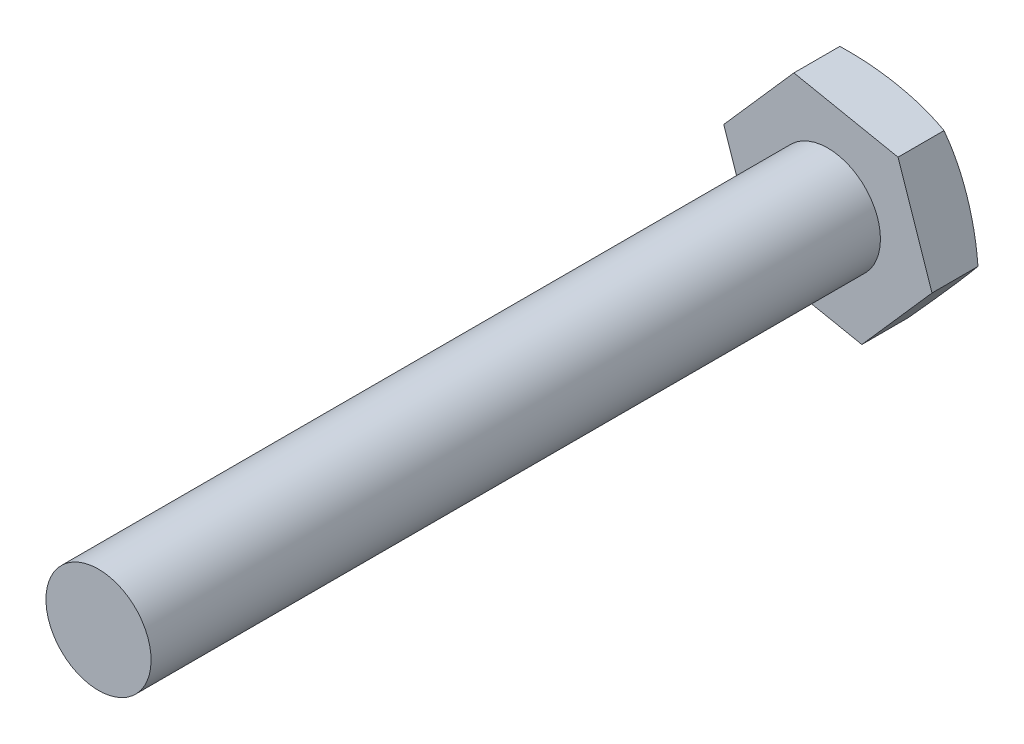
ISO-10303-21;
HEADER;
FILE_DESCRIPTION(('STEP AP214'),'2;1');
FILE_NAME('part.step','',(''),(''),'','','');
FILE_SCHEMA(('AUTOMOTIVE_DESIGN { 1 0 10303 214 1 1 1 1 }'));
ENDSEC;
DATA;
#1=APPLICATION_CONTEXT('core data for automotive mechanical design processes');
#2=APPLICATION_PROTOCOL_DEFINITION('international standard','automotive_design',2000,#1);
#3=PRODUCT_CONTEXT('',#1,'mechanical');
#4=PRODUCT('Part','Part','',(#3));
#5=PRODUCT_RELATED_PRODUCT_CATEGORY('part','',(#4));
#6=PRODUCT_DEFINITION_FORMATION('','',#4);
#7=PRODUCT_DEFINITION_CONTEXT('part definition',#1,'design');
#8=PRODUCT_DEFINITION('design','',#6,#7);
#9=PRODUCT_DEFINITION_SHAPE('','',#8);
#10=(LENGTH_UNIT() NAMED_UNIT(*) SI_UNIT(.MILLI.,.METRE.));
#11=(NAMED_UNIT(*) PLANE_ANGLE_UNIT() SI_UNIT($,.RADIAN.));
#12=(NAMED_UNIT(*) SI_UNIT($,.STERADIAN.) SOLID_ANGLE_UNIT());
#13=UNCERTAINTY_MEASURE_WITH_UNIT(LENGTH_MEASURE(1.E-05),#10,'distance_accuracy_value','');
#14=(GEOMETRIC_REPRESENTATION_CONTEXT(3) GLOBAL_UNCERTAINTY_ASSIGNED_CONTEXT((#13)) GLOBAL_UNIT_ASSIGNED_CONTEXT((#10,
#11,#12)) REPRESENTATION_CONTEXT('',''));
#15=CARTESIAN_POINT('',(0.,0.,0.));
#16=DIRECTION('',(0.,0.,1.));
#17=DIRECTION('',(1.,0.,0.));
#18=AXIS2_PLACEMENT_3D('',#15,#16,#17);
#19=CARTESIAN_POINT('',(0.,0.,-12.0620950460362));
#20=DIRECTION('',(0.,0.,1.));
#21=DIRECTION('',(-0.660629158616776,-0.750712404843087,0.));
#22=AXIS2_PLACEMENT_3D('',#19,#20,#21);
#23=DEGENERATE_TOROIDAL_SURFACE('',#22,1.60360211733348,15.825120832035,.T.);
#24=CARTESIAN_POINT('',(0.,0.,-27.5));
#25=DIRECTION('',(0.,0.,1.));
#26=DIRECTION('',(-0.660629158616776,-0.750712404843087,0.));
#27=AXIS2_PLACEMENT_3D('',#24,#25,#26);
#28=CIRCLE('',#27,5.08290376865477);
#29=CARTESIAN_POINT('',(3.35791444001644,3.81579891175281,-27.5));
#30=VERTEX_POINT('',#29);
#31=EDGE_CURVE('E11',#30,#30,#28,.T.);
#32=ORIENTED_EDGE('',*,*,#31,.T.);
#33=EDGE_LOOP('',(#32));
#34=FACE_BOUND('',#33,.T.);
#35=CARTESIAN_POINT('',(-5.33980191586677,-6.06793612628208,-26.5));
#36=CARTESIAN_POINT('',(-3.42857666963628,-6.45149758553837,-26.9374014168161));
#37=CARTESIAN_POINT('',(-1.38862462773706,-6.86089306812051,-26.9386953781707));
#38=CARTESIAN_POINT('',(0.662521676712027,-7.27253511357502,-26.9399964401544));
#39=CARTESIAN_POINT('',(2.58508587596822,-7.65837217345847,-26.5));
#40=B_SPLINE_CURVE_WITH_KNOTS('',2,(#35,#36,#37,#38,#39),.UNSPECIFIED.,.F.,.F.,(3,2,3),(0.,0.5,
1.),.UNSPECIFIED.);
#41=CARTESIAN_POINT('',(-5.33980191586677,-6.06793612628208,-26.5));
#42=VERTEX_POINT('',#41);
#43=CARTESIAN_POINT('',(2.58508587596823,-7.65837217345848,-26.5));
#44=VERTEX_POINT('',#43);
#45=EDGE_CURVE('E270',#42,#44,#40,.T.);
#46=ORIENTED_EDGE('',*,*,#45,.F.);
#47=CARTESIAN_POINT('',(-7.924887791835,1.59043604717639,-26.5));
#48=CARTESIAN_POINT('',(-7.30144913631892,-0.256514298128632,-26.9374014168368));
#49=CARTESIAN_POINT('',(-6.63602000350944,-2.22786233011927,-26.9386953781707));
#50=CARTESIAN_POINT('',(-5.96693931988491,-4.21002815946506,-26.9399964401338));
#51=CARTESIAN_POINT('',(-5.33980191586677,-6.06793612628208,-26.5));
#52=B_SPLINE_CURVE_WITH_KNOTS('',2,(#47,#48,#49,#50,#51),.UNSPECIFIED.,.F.,.F.,(3,2,3),(0.,0.5,
1.),.UNSPECIFIED.);
#53=CARTESIAN_POINT('',(-7.924887791835,1.59043604717639,-26.5));
#54=VERTEX_POINT('',#53);
#55=EDGE_CURVE('E198',#54,#42,#52,.T.);
#56=ORIENTED_EDGE('',*,*,#55,.F.);
#57=CARTESIAN_POINT('',(-2.58508587596823,7.65837217345848,-26.5));
#58=CARTESIAN_POINT('',(-3.88282871774633,6.1836694042695,-26.9407830938268));
#59=CARTESIAN_POINT('',(-5.26809479738887,4.60950874782281,-26.9386885989549));
#60=CARTESIAN_POINT('',(-6.63941599543196,3.05119449395197,-26.9366151884678));
#61=CARTESIAN_POINT('',(-7.924887791835,1.5904360471764,-26.5));
#62=B_SPLINE_CURVE_WITH_KNOTS('',2,(#57,#58,#59,#60,#61),.UNSPECIFIED.,.F.,.F.,(3,2,3),(0.,0.5,
1.),.UNSPECIFIED.);
#63=CARTESIAN_POINT('',(-2.58508587596822,7.65837217345848,-26.5));
#64=VERTEX_POINT('',#63);
#65=EDGE_CURVE('E128',#64,#54,#62,.T.);
#66=ORIENTED_EDGE('',*,*,#65,.F.);
#67=CARTESIAN_POINT('',(5.33980191586678,6.06793612628207,-26.5));
#68=CARTESIAN_POINT('',(3.4285766695762,6.45149758555041,-26.9374014168299));
#69=CARTESIAN_POINT('',(1.38862462773706,6.8608930681205,-26.9386953781707));
#70=CARTESIAN_POINT('',(-0.662521676772118,7.27253511358707,-26.9399964401407));
#71=CARTESIAN_POINT('',(-2.58508587596822,7.65837217345847,-26.5));
#72=B_SPLINE_CURVE_WITH_KNOTS('',2,(#67,#68,#69,#70,#71),.UNSPECIFIED.,.F.,.F.,(3,2,3),(0.,0.5,
1.),.UNSPECIFIED.);
#73=CARTESIAN_POINT('',(5.33980191586678,6.06793612628207,-26.5));
#74=VERTEX_POINT('',#73);
#75=EDGE_CURVE('E122',#74,#64,#72,.T.);
#76=ORIENTED_EDGE('',*,*,#75,.F.);
#77=CARTESIAN_POINT('',(7.924887791835,-1.59043604717641,-26.5));
#78=CARTESIAN_POINT('',(7.30144913632873,0.256514298099568,-26.9374014168299));
#79=CARTESIAN_POINT('',(6.63602000350944,2.22786233011925,-26.9386953781707));
#80=CARTESIAN_POINT('',(5.9669393198947,4.21002815943605,-26.9399964401407));
#81=CARTESIAN_POINT('',(5.33980191586677,6.06793612628207,-26.5));
#82=B_SPLINE_CURVE_WITH_KNOTS('',2,(#77,#78,#79,#80,#81),.UNSPECIFIED.,.F.,.F.,(3,2,3),(0.,0.5,
1.),.UNSPECIFIED.);
#83=CARTESIAN_POINT('',(7.924887791835,-1.59043604717642,-26.5));
#84=VERTEX_POINT('',#83);
#85=EDGE_CURVE('E125',#84,#74,#82,.T.);
#86=ORIENTED_EDGE('',*,*,#85,.F.);
#87=CARTESIAN_POINT('',(2.58508587596823,-7.65837217345848,-26.5));
#88=CARTESIAN_POINT('',(3.88282871774635,-6.18366940426948,-26.9407830938268));
#89=CARTESIAN_POINT('',(5.26809479739,-4.60950874782154,-26.9386885989549));
#90=CARTESIAN_POINT('',(6.63941599543196,-3.05119449395196,-26.9366151884678));
#91=CARTESIAN_POINT('',(7.924887791835,-1.59043604717641,-26.5));
#92=B_SPLINE_CURVE_WITH_KNOTS('',2,(#87,#88,#89,#90,#91),.UNSPECIFIED.,.F.,.F.,(3,2,3),(0.,0.5,
1.),.UNSPECIFIED.);
#93=EDGE_CURVE('E78',#44,#84,#92,.T.);
#94=ORIENTED_EDGE('',*,*,#93,.F.);
#95=EDGE_LOOP('',(#46,#56,#66,#76,#86,#94));
#96=FACE_BOUND('',#95,.T.);
#97=ADVANCED_FACE('F16',(#34,#96),#23,.T.);
#98=CARTESIAN_POINT('',(0.,0.,32.5));
#99=DIRECTION('',(0.,0.,-1.));
#100=DIRECTION('',(0.660629158616776,0.750712404843087,0.));
#101=AXIS2_PLACEMENT_3D('',#98,#99,#100);
#102=CYLINDRICAL_SURFACE('',#101,4.);
#103=CARTESIAN_POINT('',(0.,0.,32.5));
#104=DIRECTION('',(0.,0.,1.));
#105=DIRECTION('',(-0.660629158616776,-0.750712404843087,0.));
#106=AXIS2_PLACEMENT_3D('',#103,#104,#105);
#107=CIRCLE('',#106,4.);
#108=CARTESIAN_POINT('',(2.6425166344671,3.00284961937235,32.5));
#109=VERTEX_POINT('',#108);
#110=EDGE_CURVE('E67',#109,#109,#107,.T.);
#111=ORIENTED_EDGE('',*,*,#110,.F.);
#112=EDGE_LOOP('',(#111));
#113=FACE_BOUND('',#112,.T.);
#114=CARTESIAN_POINT('',(0.,0.,-23.));
#115=DIRECTION('',(0.,0.,1.));
#116=DIRECTION('',(-0.660629158616776,-0.750712404843087,0.));
#117=AXIS2_PLACEMENT_3D('',#114,#115,#116);
#118=CIRCLE('',#117,4.);
#119=CARTESIAN_POINT('',(2.6425166344671,3.00284961937235,-23.));
#120=VERTEX_POINT('',#119);
#121=EDGE_CURVE('E30',#120,#120,#118,.T.);
#122=ORIENTED_EDGE('',*,*,#121,.T.);
#123=EDGE_LOOP('',(#122));
#124=FACE_BOUND('',#123,.T.);
#125=ADVANCED_FACE('F183',(#113,#124),#102,.T.);
#126=CARTESIAN_POINT('',(0.,0.,32.5));
#127=DIRECTION('',(0.,0.,1.));
#128=DIRECTION('',(-0.660629158616776,-0.750712404843087,0.));
#129=AXIS2_PLACEMENT_3D('',#126,#127,#128);
#130=PLANE('',#129);
#131=ORIENTED_EDGE('',*,*,#110,.T.);
#132=EDGE_LOOP('',(#131));
#133=FACE_BOUND('',#132,.T.);
#134=ADVANCED_FACE('F344',(#133),#130,.T.);
#135=CARTESIAN_POINT('',(0.,0.,-23.));
#136=DIRECTION('',(0.,0.,1.));
#137=DIRECTION('',(-0.660629158616776,-0.750712404843087,0.));
#138=AXIS2_PLACEMENT_3D('',#135,#136,#137);
#139=PLANE('',#138);
#140=DIRECTION('',(0.319821434221834,-0.947477836264411,0.));
#141=VECTOR('',#140,1.);
#142=CARTESIAN_POINT('',(-7.924887791835,1.59043604717639,-23.));
#143=LINE('',#142,#141);
#144=CARTESIAN_POINT('',(-7.924887791835,1.59043604717639,-23.));
#145=VERTEX_POINT('',#144);
#146=CARTESIAN_POINT('',(-5.33980191586677,-6.06793612628208,-23.));
#147=VERTEX_POINT('',#146);
#148=EDGE_CURVE('E304',#145,#147,#143,.T.);
#149=ORIENTED_EDGE('',*,*,#148,.T.);
#150=DIRECTION('',(0.980450592838609,-0.196765431421323,0.));
#151=VECTOR('',#150,1.);
#152=CARTESIAN_POINT('',(-5.33980191586677,-6.06793612628208,-23.));
#153=LINE('',#152,#151);
#154=CARTESIAN_POINT('',(2.58508587596823,-7.65837217345848,-23.));
#155=VERTEX_POINT('',#154);
#156=EDGE_CURVE('E99',#147,#155,#153,.T.);
#157=ORIENTED_EDGE('',*,*,#156,.T.);
#158=DIRECTION('',(0.660629158616776,0.750712404843087,0.));
#159=VECTOR('',#158,1.);
#160=CARTESIAN_POINT('',(2.58508587596823,-7.65837217345848,-23.));
#161=LINE('',#160,#159);
#162=CARTESIAN_POINT('',(7.924887791835,-1.5904360471764,-23.));
#163=VERTEX_POINT('',#162);
#164=EDGE_CURVE('E110',#155,#163,#161,.T.);
#165=ORIENTED_EDGE('',*,*,#164,.T.);
#166=DIRECTION('',(-0.319821434221834,0.947477836264411,0.));
#167=VECTOR('',#166,1.);
#168=CARTESIAN_POINT('',(7.924887791835,-1.5904360471764,-23.));
#169=LINE('',#168,#167);
#170=CARTESIAN_POINT('',(5.33980191586677,6.06793612628207,-23.));
#171=VERTEX_POINT('',#170);
#172=EDGE_CURVE('E326',#163,#171,#169,.T.);
#173=ORIENTED_EDGE('',*,*,#172,.T.);
#174=DIRECTION('',(-0.980450592838609,0.196765431421323,0.));
#175=VECTOR('',#174,1.);
#176=CARTESIAN_POINT('',(5.33980191586677,6.06793612628207,-23.));
#177=LINE('',#176,#175);
#178=CARTESIAN_POINT('',(-2.58508587596824,7.65837217345847,-23.));
#179=VERTEX_POINT('',#178);
#180=EDGE_CURVE('E149',#171,#179,#177,.T.);
#181=ORIENTED_EDGE('',*,*,#180,.T.);
#182=DIRECTION('',(-0.660629158616776,-0.750712404843087,0.));
#183=VECTOR('',#182,1.);
#184=CARTESIAN_POINT('',(-2.58508587596824,7.65837217345847,-23.));
#185=LINE('',#184,#183);
#186=EDGE_CURVE('E290',#179,#145,#185,.T.);
#187=ORIENTED_EDGE('',*,*,#186,.T.);
#188=EDGE_LOOP('',(#149,#157,#165,#173,#181,#187));
#189=FACE_BOUND('',#188,.T.);
#190=ORIENTED_EDGE('',*,*,#121,.F.);
#191=EDGE_LOOP('',(#190));
#192=FACE_BOUND('',#191,.T.);
#193=ADVANCED_FACE('F181',(#189,#192),#139,.T.);
#194=CARTESIAN_POINT('',(-7.924887791835,1.59043604717639,-23.));
#195=DIRECTION('',(0.947477836264411,0.319821434221834,0.));
#196=DIRECTION('',(0.,0.,1.));
#197=AXIS2_PLACEMENT_3D('',#194,#195,#196);
#198=PLANE('',#197);
#199=DIRECTION('',(0.,0.,-1.));
#200=VECTOR('',#199,1.);
#201=CARTESIAN_POINT('',(-7.924887791835,1.59043604717639,-23.));
#202=LINE('',#201,#200);
#203=EDGE_CURVE('E203',#145,#54,#202,.T.);
#204=ORIENTED_EDGE('',*,*,#203,.T.);
#205=ORIENTED_EDGE('',*,*,#55,.T.);
#206=DIRECTION('',(0.,0.,-1.));
#207=VECTOR('',#206,1.);
#208=CARTESIAN_POINT('',(-5.33980191586677,-6.06793612628208,-23.));
#209=LINE('',#208,#207);
#210=EDGE_CURVE('E276',#147,#42,#209,.T.);
#211=ORIENTED_EDGE('',*,*,#210,.F.);
#212=ORIENTED_EDGE('',*,*,#148,.F.);
#213=EDGE_LOOP('',(#204,#205,#211,#212));
#214=FACE_BOUND('',#213,.T.);
#215=ADVANCED_FACE('F176',(#214),#198,.F.);
#216=CARTESIAN_POINT('',(-5.33980191586677,-6.06793612628208,-23.));
#217=DIRECTION('',(0.196765431421323,0.980450592838609,0.));
#218=DIRECTION('',(0.980450592838609,-0.196765431421323,0.));
#219=AXIS2_PLACEMENT_3D('',#216,#217,#218);
#220=PLANE('',#219);
#221=ORIENTED_EDGE('',*,*,#210,.T.);
#222=ORIENTED_EDGE('',*,*,#45,.T.);
#223=DIRECTION('',(0.,0.,-1.));
#224=VECTOR('',#223,1.);
#225=CARTESIAN_POINT('',(2.58508587596823,-7.65837217345848,-23.));
#226=LINE('',#225,#224);
#227=EDGE_CURVE('E268',#155,#44,#226,.T.);
#228=ORIENTED_EDGE('',*,*,#227,.F.);
#229=ORIENTED_EDGE('',*,*,#156,.F.);
#230=EDGE_LOOP('',(#221,#222,#228,#229));
#231=FACE_BOUND('',#230,.T.);
#232=ADVANCED_FACE('F180',(#231),#220,.F.);
#233=CARTESIAN_POINT('',(2.58508587596823,-7.65837217345848,-23.));
#234=DIRECTION('',(-0.750712404843087,0.660629158616776,0.));
#235=DIRECTION('',(0.,0.,-1.));
#236=AXIS2_PLACEMENT_3D('',#233,#234,#235);
#237=PLANE('',#236);
#238=ORIENTED_EDGE('',*,*,#227,.T.);
#239=ORIENTED_EDGE('',*,*,#93,.T.);
#240=DIRECTION('',(0.,0.,-1.));
#241=VECTOR('',#240,1.);
#242=CARTESIAN_POINT('',(7.924887791835,-1.5904360471764,-23.));
#243=LINE('',#242,#241);
#244=EDGE_CURVE('E143',#163,#84,#243,.T.);
#245=ORIENTED_EDGE('',*,*,#244,.F.);
#246=ORIENTED_EDGE('',*,*,#164,.F.);
#247=EDGE_LOOP('',(#238,#239,#245,#246));
#248=FACE_BOUND('',#247,.T.);
#249=ADVANCED_FACE('F254',(#248),#237,.F.);
#250=CARTESIAN_POINT('',(7.924887791835,-1.5904360471764,-23.));
#251=DIRECTION('',(-0.947477836264411,-0.319821434221834,0.));
#252=DIRECTION('',(0.,0.,-1.));
#253=AXIS2_PLACEMENT_3D('',#250,#251,#252);
#254=PLANE('',#253);
#255=ORIENTED_EDGE('',*,*,#244,.T.);
#256=ORIENTED_EDGE('',*,*,#85,.T.);
#257=DIRECTION('',(0.,0.,-1.));
#258=VECTOR('',#257,1.);
#259=CARTESIAN_POINT('',(5.33980191586677,6.06793612628207,-23.));
#260=LINE('',#259,#258);
#261=EDGE_CURVE('E135',#171,#74,#260,.T.);
#262=ORIENTED_EDGE('',*,*,#261,.F.);
#263=ORIENTED_EDGE('',*,*,#172,.F.);
#264=EDGE_LOOP('',(#255,#256,#262,#263));
#265=FACE_BOUND('',#264,.T.);
#266=ADVANCED_FACE('F18',(#265),#254,.F.);
#267=CARTESIAN_POINT('',(5.33980191586677,6.06793612628207,-23.));
#268=DIRECTION('',(-0.196765431421323,-0.980450592838609,0.));
#269=DIRECTION('',(0.,0.,-1.));
#270=AXIS2_PLACEMENT_3D('',#267,#268,#269);
#271=PLANE('',#270);
#272=ORIENTED_EDGE('',*,*,#261,.T.);
#273=ORIENTED_EDGE('',*,*,#75,.T.);
#274=DIRECTION('',(0.,0.,-1.));
#275=VECTOR('',#274,1.);
#276=CARTESIAN_POINT('',(-2.58508587596824,7.65837217345847,-23.));
#277=LINE('',#276,#275);
#278=EDGE_CURVE('E136',#179,#64,#277,.T.);
#279=ORIENTED_EDGE('',*,*,#278,.F.);
#280=ORIENTED_EDGE('',*,*,#180,.F.);
#281=EDGE_LOOP('',(#272,#273,#279,#280));
#282=FACE_BOUND('',#281,.T.);
#283=ADVANCED_FACE('F147',(#282),#271,.F.);
#284=CARTESIAN_POINT('',(-2.58508587596824,7.65837217345847,-23.));
#285=DIRECTION('',(0.750712404843087,-0.660629158616776,0.));
#286=DIRECTION('',(-0.660629158616776,-0.750712404843087,0.));
#287=AXIS2_PLACEMENT_3D('',#284,#285,#286);
#288=PLANE('',#287);
#289=ORIENTED_EDGE('',*,*,#278,.T.);
#290=ORIENTED_EDGE('',*,*,#65,.T.);
#291=ORIENTED_EDGE('',*,*,#203,.F.);
#292=ORIENTED_EDGE('',*,*,#186,.F.);
#293=EDGE_LOOP('',(#289,#290,#291,#292));
#294=FACE_BOUND('',#293,.T.);
#295=ADVANCED_FACE('F173',(#294),#288,.F.);
#296=CARTESIAN_POINT('',(0.,0.,-27.5));
#297=DIRECTION('',(0.,0.,1.));
#298=DIRECTION('',(-0.660629158616776,-0.750712404843087,0.));
#299=AXIS2_PLACEMENT_3D('',#296,#297,#298);
#300=PLANE('',#299);
#301=ORIENTED_EDGE('',*,*,#31,.F.);
#302=EDGE_LOOP('',(#301));
#303=FACE_BOUND('',#302,.T.);
#304=ADVANCED_FACE('F174',(#303),#300,.F.);
#305=CLOSED_SHELL('',(#97,#125,#134,#193,#215,#232,#249,#266,#283,#295,#304));
#306=MANIFOLD_SOLID_BREP('B1',#305);
#307=ADVANCED_BREP_SHAPE_REPRESENTATION('',(#18,#306),#14);
#308=SHAPE_DEFINITION_REPRESENTATION(#9,#307);
ENDSEC;
END-ISO-10303-21;
